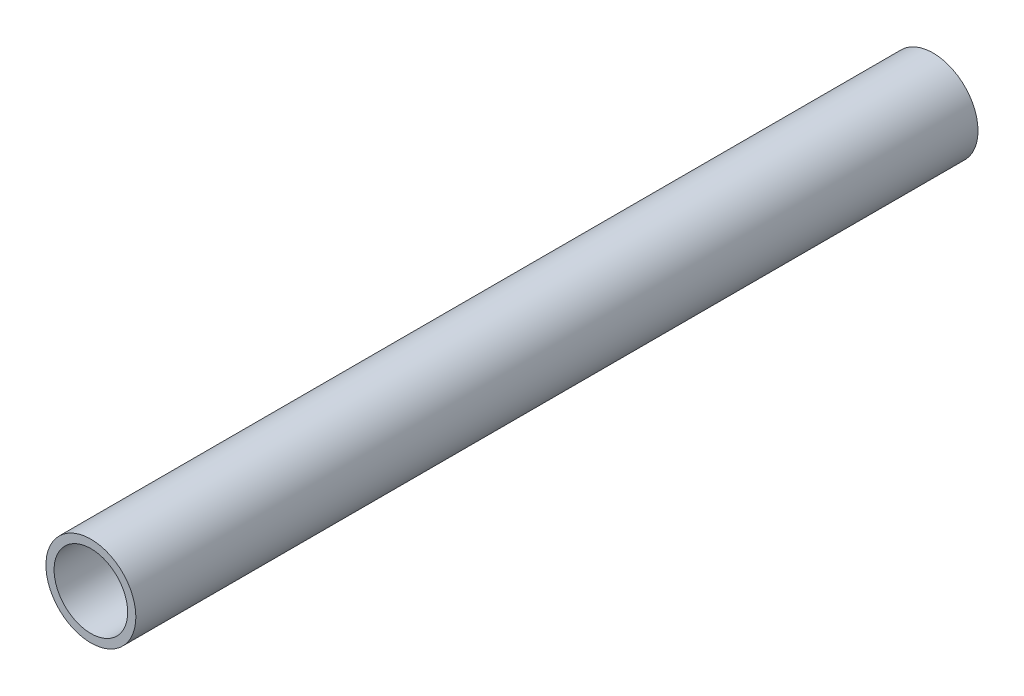
ISO-10303-21;
HEADER;
FILE_DESCRIPTION(('STEP AP214'),'2;1');
FILE_NAME('part.step','',(''),(''),'','','');
FILE_SCHEMA(('AUTOMOTIVE_DESIGN { 1 0 10303 214 1 1 1 1 }'));
ENDSEC;
DATA;
#1=APPLICATION_CONTEXT('core data for automotive mechanical design processes');
#2=APPLICATION_PROTOCOL_DEFINITION('international standard','automotive_design',2000,#1);
#3=PRODUCT_CONTEXT('',#1,'mechanical');
#4=PRODUCT('Part','Part','',(#3));
#5=PRODUCT_RELATED_PRODUCT_CATEGORY('part','',(#4));
#6=PRODUCT_DEFINITION_FORMATION('','',#4);
#7=PRODUCT_DEFINITION_CONTEXT('part definition',#1,'design');
#8=PRODUCT_DEFINITION('design','',#6,#7);
#9=PRODUCT_DEFINITION_SHAPE('','',#8);
#10=(LENGTH_UNIT() NAMED_UNIT(*) SI_UNIT(.MILLI.,.METRE.));
#11=(NAMED_UNIT(*) PLANE_ANGLE_UNIT() SI_UNIT($,.RADIAN.));
#12=(NAMED_UNIT(*) SI_UNIT($,.STERADIAN.) SOLID_ANGLE_UNIT());
#13=UNCERTAINTY_MEASURE_WITH_UNIT(LENGTH_MEASURE(1.E-05),#10,'distance_accuracy_value','');
#14=(GEOMETRIC_REPRESENTATION_CONTEXT(3) GLOBAL_UNCERTAINTY_ASSIGNED_CONTEXT((#13)) GLOBAL_UNIT_ASSIGNED_CONTEXT((#10,
#11,#12)) REPRESENTATION_CONTEXT('',''));
#15=CARTESIAN_POINT('',(0.,0.,0.));
#16=DIRECTION('',(0.,0.,1.));
#17=DIRECTION('',(1.,0.,0.));
#18=AXIS2_PLACEMENT_3D('',#15,#16,#17);
#19=CARTESIAN_POINT('',(0.,0.,103.));
#20=DIRECTION('',(0.,0.,1.));
#21=DIRECTION('',(1.,0.,0.));
#22=AXIS2_PLACEMENT_3D('',#19,#20,#21);
#23=PLANE('',#22);
#24=CARTESIAN_POINT('',(0.,0.,103.));
#25=DIRECTION('',(0.,0.,1.));
#26=DIRECTION('',(1.,0.,0.));
#27=AXIS2_PLACEMENT_3D('',#24,#25,#26);
#28=CIRCLE('',#27,5.5);
#29=CARTESIAN_POINT('',(5.5,0.,103.));
#30=VERTEX_POINT('',#29);
#31=EDGE_CURVE('E10',#30,#30,#28,.T.);
#32=ORIENTED_EDGE('',*,*,#31,.T.);
#33=EDGE_LOOP('',(#32));
#34=FACE_BOUND('',#33,.T.);
#35=CARTESIAN_POINT('',(0.,0.,103.));
#36=DIRECTION('',(0.,0.,1.));
#37=DIRECTION('',(1.,0.,0.));
#38=AXIS2_PLACEMENT_3D('',#35,#36,#37);
#39=CIRCLE('',#38,4.5);
#40=CARTESIAN_POINT('',(4.5,0.,103.));
#41=VERTEX_POINT('',#40);
#42=EDGE_CURVE('E41',#41,#41,#39,.T.);
#43=ORIENTED_EDGE('',*,*,#42,.F.);
#44=EDGE_LOOP('',(#43));
#45=FACE_BOUND('',#44,.T.);
#46=ADVANCED_FACE('F30',(#34,#45),#23,.T.);
#47=CARTESIAN_POINT('',(0.,0.,0.));
#48=DIRECTION('',(0.,0.,1.));
#49=DIRECTION('',(1.,0.,0.));
#50=AXIS2_PLACEMENT_3D('',#47,#48,#49);
#51=PLANE('',#50);
#52=CARTESIAN_POINT('',(0.,0.,0.));
#53=DIRECTION('',(0.,0.,1.));
#54=DIRECTION('',(1.,0.,0.));
#55=AXIS2_PLACEMENT_3D('',#52,#53,#54);
#56=CIRCLE('',#55,5.5);
#57=CARTESIAN_POINT('',(5.5,0.,0.));
#58=VERTEX_POINT('',#57);
#59=EDGE_CURVE('E34',#58,#58,#56,.T.);
#60=ORIENTED_EDGE('',*,*,#59,.F.);
#61=EDGE_LOOP('',(#60));
#62=FACE_BOUND('',#61,.T.);
#63=CARTESIAN_POINT('',(0.,0.,0.));
#64=DIRECTION('',(0.,0.,1.));
#65=DIRECTION('',(1.,0.,0.));
#66=AXIS2_PLACEMENT_3D('',#63,#64,#65);
#67=CIRCLE('',#66,4.5);
#68=CARTESIAN_POINT('',(4.5,0.,0.));
#69=VERTEX_POINT('',#68);
#70=EDGE_CURVE('E43',#69,#69,#67,.T.);
#71=ORIENTED_EDGE('',*,*,#70,.T.);
#72=EDGE_LOOP('',(#71));
#73=FACE_BOUND('',#72,.T.);
#74=ADVANCED_FACE('F53',(#62,#73),#51,.F.);
#75=CARTESIAN_POINT('',(0.,0.,103.));
#76=DIRECTION('',(0.,0.,-1.));
#77=DIRECTION('',(-1.,0.,0.));
#78=AXIS2_PLACEMENT_3D('',#75,#76,#77);
#79=CYLINDRICAL_SURFACE('',#78,5.5);
#80=ORIENTED_EDGE('',*,*,#31,.F.);
#81=EDGE_LOOP('',(#80));
#82=FACE_BOUND('',#81,.T.);
#83=ORIENTED_EDGE('',*,*,#59,.T.);
#84=EDGE_LOOP('',(#83));
#85=FACE_BOUND('',#84,.T.);
#86=ADVANCED_FACE('F32',(#82,#85),#79,.T.);
#87=CARTESIAN_POINT('',(0.,0.,103.));
#88=DIRECTION('',(0.,0.,-1.));
#89=DIRECTION('',(-1.,0.,0.));
#90=AXIS2_PLACEMENT_3D('',#87,#88,#89);
#91=CYLINDRICAL_SURFACE('',#90,4.5);
#92=ORIENTED_EDGE('',*,*,#42,.T.);
#93=EDGE_LOOP('',(#92));
#94=FACE_BOUND('',#93,.T.);
#95=ORIENTED_EDGE('',*,*,#70,.F.);
#96=EDGE_LOOP('',(#95));
#97=FACE_BOUND('',#96,.T.);
#98=ADVANCED_FACE('F49',(#94,#97),#91,.F.);
#99=CLOSED_SHELL('',(#46,#74,#86,#98));
#100=MANIFOLD_SOLID_BREP('B2',#99);
#101=ADVANCED_BREP_SHAPE_REPRESENTATION('',(#18,#100),#14);
#102=SHAPE_DEFINITION_REPRESENTATION(#9,#101);
ENDSEC;
END-ISO-10303-21;
